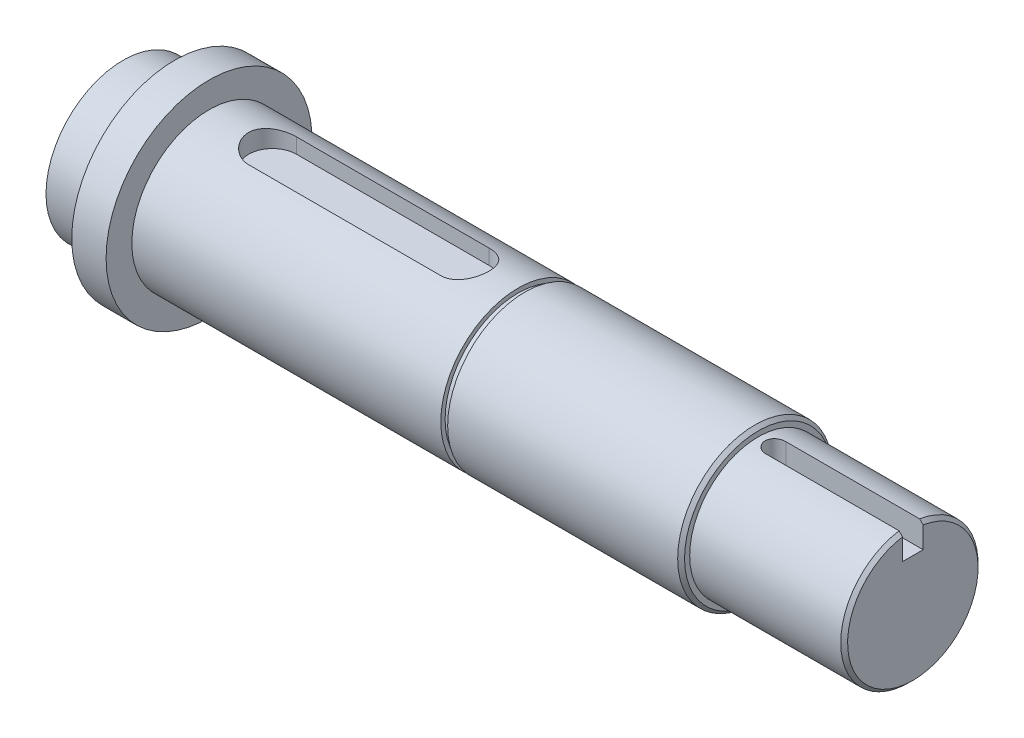
ISO-10303-21;
HEADER;
FILE_DESCRIPTION(('STEP AP214'),'2;1');
FILE_NAME('part.step','',(''),(''),'','','');
FILE_SCHEMA(('AUTOMOTIVE_DESIGN { 1 0 10303 214 1 1 1 1 }'));
ENDSEC;
DATA;
#1=APPLICATION_CONTEXT('core data for automotive mechanical design processes');
#2=APPLICATION_PROTOCOL_DEFINITION('international standard','automotive_design',2000,#1);
#3=PRODUCT_CONTEXT('',#1,'mechanical');
#4=PRODUCT('Part','Part','',(#3));
#5=PRODUCT_RELATED_PRODUCT_CATEGORY('part','',(#4));
#6=PRODUCT_DEFINITION_FORMATION('','',#4);
#7=PRODUCT_DEFINITION_CONTEXT('part definition',#1,'design');
#8=PRODUCT_DEFINITION('design','',#6,#7);
#9=PRODUCT_DEFINITION_SHAPE('','',#8);
#10=(LENGTH_UNIT() NAMED_UNIT(*) SI_UNIT(.MILLI.,.METRE.));
#11=(NAMED_UNIT(*) PLANE_ANGLE_UNIT() SI_UNIT($,.RADIAN.));
#12=(NAMED_UNIT(*) SI_UNIT($,.STERADIAN.) SOLID_ANGLE_UNIT());
#13=UNCERTAINTY_MEASURE_WITH_UNIT(LENGTH_MEASURE(1.E-05),#10,'distance_accuracy_value','');
#14=(GEOMETRIC_REPRESENTATION_CONTEXT(3) GLOBAL_UNCERTAINTY_ASSIGNED_CONTEXT((#13)) GLOBAL_UNIT_ASSIGNED_CONTEXT((#10,
#11,#12)) REPRESENTATION_CONTEXT('',''));
#15=CARTESIAN_POINT('',(0.,0.,0.));
#16=DIRECTION('',(0.,0.,1.));
#17=DIRECTION('',(1.,0.,0.));
#18=AXIS2_PLACEMENT_3D('',#15,#16,#17);
#19=CARTESIAN_POINT('',(0.,0.,0.));
#20=DIRECTION('',(1.,0.,0.));
#21=DIRECTION('',(0.,0.,-1.));
#22=AXIS2_PLACEMENT_3D('',#19,#20,#21);
#23=PLANE('',#22);
#24=CARTESIAN_POINT('',(0.,0.,0.));
#25=DIRECTION('',(-1.,0.,0.));
#26=DIRECTION('',(0.,0.,1.));
#27=AXIS2_PLACEMENT_3D('',#24,#25,#26);
#28=CIRCLE('',#27,22.5);
#29=CARTESIAN_POINT('',(0.,0.,22.5));
#30=VERTEX_POINT('',#29);
#31=EDGE_CURVE('E197',#30,#30,#28,.T.);
#32=ORIENTED_EDGE('',*,*,#31,.T.);
#33=EDGE_LOOP('',(#32));
#34=FACE_BOUND('',#33,.T.);
#35=ADVANCED_FACE('F42',(#34),#23,.F.);
#36=CARTESIAN_POINT('',(-258.805394990366,0.,0.));
#37=DIRECTION('',(-1.,0.,0.));
#38=DIRECTION('',(0.,0.,1.));
#39=AXIS2_PLACEMENT_3D('',#36,#37,#38);
#40=CYLINDRICAL_SURFACE('',#39,22.5);
#41=ORIENTED_EDGE('',*,*,#31,.F.);
#42=EDGE_LOOP('',(#41));
#43=FACE_BOUND('',#42,.T.);
#44=CARTESIAN_POINT('',(15.,0.,0.));
#45=DIRECTION('',(-1.,0.,0.));
#46=DIRECTION('',(0.,0.,1.));
#47=AXIS2_PLACEMENT_3D('',#44,#45,#46);
#48=CIRCLE('',#47,22.5);
#49=CARTESIAN_POINT('',(15.,0.,22.5));
#50=VERTEX_POINT('',#49);
#51=EDGE_CURVE('E194',#50,#50,#48,.T.);
#52=ORIENTED_EDGE('',*,*,#51,.T.);
#53=EDGE_LOOP('',(#52));
#54=FACE_BOUND('',#53,.T.);
#55=ADVANCED_FACE('F291',(#43,#54),#40,.T.);
#56=CARTESIAN_POINT('',(15.,22.5,0.));
#57=DIRECTION('',(1.,0.,0.));
#58=DIRECTION('',(0.,0.,-1.));
#59=AXIS2_PLACEMENT_3D('',#56,#57,#58);
#60=PLANE('',#59);
#61=ORIENTED_EDGE('',*,*,#51,.F.);
#62=EDGE_LOOP('',(#61));
#63=FACE_BOUND('',#62,.T.);
#64=CARTESIAN_POINT('',(15.,0.,0.));
#65=DIRECTION('',(-1.,0.,0.));
#66=DIRECTION('',(0.,0.,1.));
#67=AXIS2_PLACEMENT_3D('',#64,#65,#66);
#68=CIRCLE('',#67,30.);
#69=CARTESIAN_POINT('',(15.,0.,30.));
#70=VERTEX_POINT('',#69);
#71=EDGE_CURVE('E191',#70,#70,#68,.T.);
#72=ORIENTED_EDGE('',*,*,#71,.T.);
#73=EDGE_LOOP('',(#72));
#74=FACE_BOUND('',#73,.T.);
#75=ADVANCED_FACE('F296',(#63,#74),#60,.F.);
#76=CARTESIAN_POINT('',(-258.805394990366,0.,0.));
#77=DIRECTION('',(-1.,0.,0.));
#78=DIRECTION('',(0.,0.,1.));
#79=AXIS2_PLACEMENT_3D('',#76,#77,#78);
#80=CYLINDRICAL_SURFACE('',#79,30.);
#81=ORIENTED_EDGE('',*,*,#71,.F.);
#82=EDGE_LOOP('',(#81));
#83=FACE_BOUND('',#82,.T.);
#84=CARTESIAN_POINT('',(25.,0.,0.));
#85=DIRECTION('',(-1.,0.,0.));
#86=DIRECTION('',(0.,0.,1.));
#87=AXIS2_PLACEMENT_3D('',#84,#85,#86);
#88=CIRCLE('',#87,30.);
#89=CARTESIAN_POINT('',(25.,0.,30.));
#90=VERTEX_POINT('',#89);
#91=EDGE_CURVE('E188',#90,#90,#88,.T.);
#92=ORIENTED_EDGE('',*,*,#91,.T.);
#93=EDGE_LOOP('',(#92));
#94=FACE_BOUND('',#93,.T.);
#95=ADVANCED_FACE('F302',(#83,#94),#80,.T.);
#96=CARTESIAN_POINT('',(25.,30.,0.));
#97=DIRECTION('',(-1.,0.,0.));
#98=DIRECTION('',(0.,0.,1.));
#99=AXIS2_PLACEMENT_3D('',#96,#97,#98);
#100=PLANE('',#99);
#101=ORIENTED_EDGE('',*,*,#91,.F.);
#102=EDGE_LOOP('',(#101));
#103=FACE_BOUND('',#102,.T.);
#104=CARTESIAN_POINT('',(25.,0.,0.));
#105=DIRECTION('',(-1.,0.,0.));
#106=DIRECTION('',(0.,0.,1.));
#107=AXIS2_PLACEMENT_3D('',#104,#105,#106);
#108=CIRCLE('',#107,22.5);
#109=CARTESIAN_POINT('',(25.,0.,22.5));
#110=VERTEX_POINT('',#109);
#111=EDGE_CURVE('E185',#110,#110,#108,.T.);
#112=ORIENTED_EDGE('',*,*,#111,.T.);
#113=EDGE_LOOP('',(#112));
#114=FACE_BOUND('',#113,.T.);
#115=ADVANCED_FACE('F305',(#103,#114),#100,.F.);
#116=CARTESIAN_POINT('',(-258.805394990366,0.,0.));
#117=DIRECTION('',(-1.,0.,0.));
#118=DIRECTION('',(0.,0.,1.));
#119=AXIS2_PLACEMENT_3D('',#116,#117,#118);
#120=CYLINDRICAL_SURFACE('',#119,22.5);
#121=DIRECTION('',(-1.,0.,0.));
#122=VECTOR('',#121,1.);
#123=CARTESIAN_POINT('',(-258.805394990366,21.3834047803431,-7.));
#124=LINE('',#123,#122);
#125=CARTESIAN_POINT('',(43.5,21.3834047803431,-7.));
#126=VERTEX_POINT('',#125);
#127=CARTESIAN_POINT('',(99.5,21.3834047803431,-7.));
#128=VERTEX_POINT('',#127);
#129=EDGE_CURVE('E12',#126,#128,#124,.F.);
#130=ORIENTED_EDGE('',*,*,#129,.T.);
#131=CARTESIAN_POINT('',(99.5,21.3834047803431,-7.));
#132=CARTESIAN_POINT('',(99.691747962933,21.3833759755726,-7.00002638788773));
#133=CARTESIAN_POINT('',(99.8834853215038,21.3859829575454,-6.99212250357733));
#134=CARTESIAN_POINT('',(100.265489058962,21.3962580072183,-6.96064990633983));
#135=CARTESIAN_POINT('',(100.455755778655,21.4039248644627,-6.93708493994703));
#136=CARTESIAN_POINT('',(100.832958103102,21.4240824611325,-6.87456915635527));
#137=CARTESIAN_POINT('',(101.019901235473,21.4365602872848,-6.83565951993686));
#138=CARTESIAN_POINT('',(101.389662295551,21.4659469063578,-6.74281154744467));
#139=CARTESIAN_POINT('',(101.572480102144,21.4828558291851,-6.68887277075807));
#140=CARTESIAN_POINT('',(101.932628173539,21.5205859002674,-6.56646575510685));
#141=CARTESIAN_POINT('',(102.109961967382,21.5414044689111,-6.49800709263032));
#142=CARTESIAN_POINT('',(102.458189970023,21.5863628741255,-6.34705748516684));
#143=CARTESIAN_POINT('',(102.629081759612,21.6105039428958,-6.26456133146705));
#144=CARTESIAN_POINT('',(102.963322979925,21.6614246049304,-6.0861552368472));
#145=CARTESIAN_POINT('',(103.126671560951,21.6882044943834,-5.99024378964968));
#146=CARTESIAN_POINT('',(103.444892740823,21.7436799451747,-5.78563893862382));
#147=CARTESIAN_POINT('',(103.599762274424,21.7723761910783,-5.67694095648713));
#148=CARTESIAN_POINT('',(103.904649878951,21.8318094528287,-5.44398558349853));
#149=CARTESIAN_POINT('',(104.054375697672,21.8625820218381,-5.31935461263557));
#150=CARTESIAN_POINT('',(104.342885258309,21.9244995602668,-5.05809625572506));
#151=CARTESIAN_POINT('',(104.481668816275,21.9556445359364,-4.92146866808486));
#152=CARTESIAN_POINT('',(104.747469283069,22.0174752796029,-4.63702147167283));
#153=CARTESIAN_POINT('',(104.874482110225,22.0481608852367,-4.48919801262155));
#154=CARTESIAN_POINT('',(105.115815118575,22.1082274768052,-4.18336601580314));
#155=CARTESIAN_POINT('',(105.230139713703,22.1376089142809,-4.02536105036416));
#156=CARTESIAN_POINT('',(105.44782013432,22.1949382761817,-3.69637926494411));
#157=CARTESIAN_POINT('',(105.550865802136,22.222838133295,-3.52518859648671));
#158=CARTESIAN_POINT('',(105.742077396034,22.2756613074277,-3.17432985879873));
#159=CARTESIAN_POINT('',(105.83024877474,22.3005857142056,-2.99466492710899));
#160=CARTESIAN_POINT('',(105.991027505679,22.3467560378169,-2.62804567748408));
#161=CARTESIAN_POINT('',(106.063635279951,22.3680020543947,-2.44109155737344));
#162=CARTESIAN_POINT('',(106.192644415018,22.4061975627029,-2.06124657398028));
#163=CARTESIAN_POINT('',(106.249046375157,22.4231472133242,-1.86835593054216));
#164=CARTESIAN_POINT('',(106.343645794008,22.4518043567541,-1.48406965496813));
#165=CARTESIAN_POINT('',(106.382347442615,22.4636563728524,-1.29280885191943));
#166=CARTESIAN_POINT('',(106.443666983921,22.4825189363242,-0.907492281435932));
#167=CARTESIAN_POINT('',(106.466285431422,22.4895296507013,-0.713436610647587));
#168=CARTESIAN_POINT('',(106.495221071183,22.4985094688896,-0.324029619574405));
#169=CARTESIAN_POINT('',(106.501540971608,22.5004794102745,-0.128678519946821));
#170=CARTESIAN_POINT('',(106.497825624669,22.4993235348161,0.261850976266975));
#171=CARTESIAN_POINT('',(106.487790702297,22.4961978192299,0.457029376207834));
#172=CARTESIAN_POINT('',(106.452091279248,22.4851350756934,0.839016651756691));
#173=CARTESIAN_POINT('',(106.426977198409,22.4773675290497,1.02588219704709));
#174=CARTESIAN_POINT('',(106.361806715502,22.4573691656826,1.39681014394023));
#175=CARTESIAN_POINT('',(106.321745326667,22.4451368594423,1.58087158867604));
#176=CARTESIAN_POINT('',(106.227040771032,22.4165350301791,1.94480498225261));
#177=CARTESIAN_POINT('',(106.172402466504,22.4001668868012,2.12467830636909));
#178=CARTESIAN_POINT('',(106.048962208332,22.3637078769714,2.47918052521276));
#179=CARTESIAN_POINT('',(105.980154922154,22.3436156092208,2.65380741699503));
#180=CARTESIAN_POINT('',(105.828027310215,22.2999677081418,2.99866751070753));
#181=CARTESIAN_POINT('',(105.744545249901,22.2763739905048,3.16882451147411));
#182=CARTESIAN_POINT('',(105.564226510845,22.2265007734939,3.50156811170554));
#183=CARTESIAN_POINT('',(105.467385253138,22.2002203540359,3.66415208979079));
#184=CARTESIAN_POINT('',(105.261038630503,22.1456467231703,3.98072025747788));
#185=CARTESIAN_POINT('',(105.151532951898,22.1173534619146,4.13470423393206));
#186=CARTESIAN_POINT('',(104.920570196103,22.0594670226099,4.4331736760406));
#187=CARTESIAN_POINT('',(104.799112742727,22.0298738036607,4.57765884247862));
#188=CARTESIAN_POINT('',(104.539724709995,21.9688936108202,4.86207108102337));
#189=CARTESIAN_POINT('',(104.401320039388,21.9374831254957,5.00156109200341));
#190=CARTESIAN_POINT('',(104.113294186339,21.8749338799794,5.26840074524967));
#191=CARTESIAN_POINT('',(103.963676595185,21.8437950363228,5.39575424517763));
#192=CARTESIAN_POINT('',(103.654016640235,21.7826262792731,5.63762072887128));
#193=CARTESIAN_POINT('',(103.493967320647,21.7525971271591,5.75212500350362));
#194=CARTESIAN_POINT('',(103.164603799852,21.6945398510365,5.96735827855913));
#195=CARTESIAN_POINT('',(102.995293241572,21.6665109500826,6.0680926416173));
#196=CARTESIAN_POINT('',(102.64635431279,21.6129469743072,6.25621355677311));
#197=CARTESIAN_POINT('',(102.466626662005,21.5874457842966,6.34342581409757));
#198=CARTESIAN_POINT('',(102.10003436718,21.5401290954628,6.50228494842817));
#199=CARTESIAN_POINT('',(101.913172696296,21.5183120813529,6.57393822826235));
#200=CARTESIAN_POINT('',(101.533782862087,21.4790763704547,6.70102264969051));
#201=CARTESIAN_POINT('',(101.341260960584,21.4616530033951,6.75647102650282));
#202=CARTESIAN_POINT('',(100.951885948128,21.4317592713336,6.85070294339748));
#203=CARTESIAN_POINT('',(100.755034871999,21.4192866297424,6.88949414394962));
#204=CARTESIAN_POINT('',(100.381992589154,21.4008759333036,6.94646198663147));
#205=CARTESIAN_POINT('',(100.206118439217,21.3943385336146,6.96653718585291));
#206=CARTESIAN_POINT('',(99.8535006576593,21.3855959359006,6.99330547974964));
#207=CARTESIAN_POINT('',(99.6767586183217,21.3833845899213,7.00001756560227));
#208=CARTESIAN_POINT('',(99.5,21.3834047803431,7.));
#209=B_SPLINE_CURVE_WITH_KNOTS('',3,(#131,#132,#133,#134,#135,#136,#137,#138,#139,#140,#141,
#142,#143,#144,#145,#146,#147,#148,#149,#150,#151,#152,#153,#154,#155,#156,#157,#158,#159,#160,
#161,#162,#163,#164,#165,#166,#167,#168,#169,#170,#171,#172,#173,#174,#175,#176,#177,#178,#179,
#180,#181,#182,#183,#184,#185,#186,#187,#188,#189,#190,#191,#192,#193,#194,#195,#196,#197,#198,
#199,#200,#201,#202,#203,#204,#205,#206,#207,#208),.UNSPECIFIED.,.F.,.F.,(4,2,2,2,2,2,2,2,2,2,2,
2,2,2,2,2,2,2,2,2,2,2,2,2,2,2,2,2,2,2,2,2,2,2,2,2,2,2,4),(0.,0.575046969806877,1.14995642305859,
1.72333336736907,2.29672712327433,2.86974387087759,3.44297370600941,4.01626795548503,
4.58976810539893,5.18076864034281,5.77177910843487,6.36299375708562,6.95400208730354,
7.55850874723,8.16279332293318,8.76706151008844,9.37130734653417,9.95706552574568,
10.5428034978567,11.1284441375358,11.7140731399452,12.2795246614735,12.8451649995772,
13.4106168982253,13.9762819963941,14.5486246379559,15.1211639439558,15.6937174338259,
16.2662889507273,16.8625896714317,17.4587002177891,18.055212394766,18.6514915966369,
19.2549115963138,19.8580828040918,20.460610136413,21.0628600748604,21.5937197869136,
22.1238245201084),.UNSPECIFIED.);
#210=CARTESIAN_POINT('',(99.5,21.3834047803431,7.));
#211=VERTEX_POINT('',#210);
#212=EDGE_CURVE('E253',#128,#211,#209,.T.);
#213=ORIENTED_EDGE('',*,*,#212,.T.);
#214=DIRECTION('',(-1.,0.,0.));
#215=VECTOR('',#214,1.);
#216=CARTESIAN_POINT('',(-258.805394990366,21.3834047803431,7.));
#217=LINE('',#216,#215);
#218=CARTESIAN_POINT('',(43.5,21.3834047803431,7.));
#219=VERTEX_POINT('',#218);
#220=EDGE_CURVE('E50',#211,#219,#217,.T.);
#221=ORIENTED_EDGE('',*,*,#220,.T.);
#222=CARTESIAN_POINT('',(43.5,21.3834047803431,7.));
#223=CARTESIAN_POINT('',(43.3082520370671,21.3833759755726,7.00002638788773));
#224=CARTESIAN_POINT('',(43.1165146784963,21.3859829575454,6.99212250357733));
#225=CARTESIAN_POINT('',(42.7345109410377,21.3962580072183,6.96064990633983));
#226=CARTESIAN_POINT('',(42.5442442213453,21.4039248644627,6.93708493994703));
#227=CARTESIAN_POINT('',(42.1670418968984,21.4240824611325,6.87456915635527));
#228=CARTESIAN_POINT('',(41.9800987645274,21.4365602872848,6.83565951993687));
#229=CARTESIAN_POINT('',(41.6103377044495,21.4659469063578,6.74281154744467));
#230=CARTESIAN_POINT('',(41.4275198978557,21.4828558291851,6.68887277075807));
#231=CARTESIAN_POINT('',(41.0673718264613,21.5205859002674,6.56646575510685));
#232=CARTESIAN_POINT('',(40.8900380326178,21.5414044689111,6.49800709263033));
#233=CARTESIAN_POINT('',(40.5418100299767,21.5863628741255,6.34705748516684));
#234=CARTESIAN_POINT('',(40.3709182403882,21.6105039428958,6.26456133146706));
#235=CARTESIAN_POINT('',(40.0366770200747,21.6614246049304,6.0861552368472));
#236=CARTESIAN_POINT('',(39.8733284390492,21.6882044943834,5.99024378964969));
#237=CARTESIAN_POINT('',(39.5551072591769,21.7436799451747,5.78563893862383));
#238=CARTESIAN_POINT('',(39.4002377255763,21.7723761910783,5.67694095648714));
#239=CARTESIAN_POINT('',(39.0953501210494,21.8318094528287,5.44398558349853));
#240=CARTESIAN_POINT('',(38.9456243023278,21.8625820218381,5.31935461263558));
#241=CARTESIAN_POINT('',(38.6571147416907,21.9244995602668,5.05809625572507));
#242=CARTESIAN_POINT('',(38.5183311837246,21.9556445359364,4.92146866808487));
#243=CARTESIAN_POINT('',(38.2525307169311,22.0174752796029,4.63702147167283));
#244=CARTESIAN_POINT('',(38.1255178897753,22.0481608852367,4.48919801262155));
#245=CARTESIAN_POINT('',(37.884184881425,22.1082274768052,4.18336601580314));
#246=CARTESIAN_POINT('',(37.7698602862973,22.1376089142809,4.02536105036415));
#247=CARTESIAN_POINT('',(37.55217986568,22.1949382761817,3.6963792649441));
#248=CARTESIAN_POINT('',(37.4491341978637,22.222838133295,3.5251885964867));
#249=CARTESIAN_POINT('',(37.2579226039664,22.2756613074277,3.17432985879873));
#250=CARTESIAN_POINT('',(37.16975122526,22.3005857142056,2.99466492710898));
#251=CARTESIAN_POINT('',(37.0089724943215,22.3467560378169,2.62804567748407));
#252=CARTESIAN_POINT('',(36.9363647200488,22.3680020543947,2.44109155737343));
#253=CARTESIAN_POINT('',(36.8073555849817,22.4061975627029,2.06124657398027));
#254=CARTESIAN_POINT('',(36.7509536248428,22.4231472133242,1.86835593054215));
#255=CARTESIAN_POINT('',(36.6563542059918,22.4518043567541,1.48406965496813));
#256=CARTESIAN_POINT('',(36.6176525573853,22.4636563728524,1.29280885191943));
#257=CARTESIAN_POINT('',(36.5563330160787,22.4825189363242,0.907492281435928));
#258=CARTESIAN_POINT('',(36.5337145685779,22.4895296507013,0.713436610647583));
#259=CARTESIAN_POINT('',(36.5047789288171,22.4985094688896,0.324029619574402));
#260=CARTESIAN_POINT('',(36.4984590283923,22.5004794102745,0.128678519946818));
#261=CARTESIAN_POINT('',(36.5021743753308,22.4993235348161,-0.261850976266977));
#262=CARTESIAN_POINT('',(36.5122092977033,22.4961978192299,-0.457029376207836));
#263=CARTESIAN_POINT('',(36.5479087207522,22.4851350756934,-0.839016651756693));
#264=CARTESIAN_POINT('',(36.5730228015911,22.4773675290497,-1.02588219704709));
#265=CARTESIAN_POINT('',(36.6381932844985,22.4573691656826,-1.39681014394023));
#266=CARTESIAN_POINT('',(36.6782546733331,22.4451368594423,-1.58087158867604));
#267=CARTESIAN_POINT('',(36.7729592289679,22.4165350301791,-1.94480498225261));
#268=CARTESIAN_POINT('',(36.827597533496,22.4001668868012,-2.12467830636909));
#269=CARTESIAN_POINT('',(36.9510377916683,22.3637078769714,-2.47918052521276));
#270=CARTESIAN_POINT('',(37.0198450778458,22.3436156092208,-2.65380741699503));
#271=CARTESIAN_POINT('',(37.1719726897852,22.2999677081418,-2.99866751070753));
#272=CARTESIAN_POINT('',(37.2554547500994,22.2763739905048,-3.1688245114741));
#273=CARTESIAN_POINT('',(37.4357734891551,22.2265007734939,-3.50156811170554));
#274=CARTESIAN_POINT('',(37.5326147468621,22.2002203540359,-3.66415208979079));
#275=CARTESIAN_POINT('',(37.7389613694973,22.1456467231703,-3.98072025747787));
#276=CARTESIAN_POINT('',(37.8484670481018,22.1173534619146,-4.13470423393205));
#277=CARTESIAN_POINT('',(38.0794298038973,22.0594670226099,-4.43317367604059));
#278=CARTESIAN_POINT('',(38.2008872572734,22.0298738036607,-4.57765884247862));
#279=CARTESIAN_POINT('',(38.4602752900053,21.9688936108202,-4.86207108102337));
#280=CARTESIAN_POINT('',(38.5986799606122,21.9374831254957,-5.0015610920034));
#281=CARTESIAN_POINT('',(38.8867058136609,21.8749338799794,-5.26840074524966));
#282=CARTESIAN_POINT('',(39.0363234048154,21.8437950363228,-5.39575424517762));
#283=CARTESIAN_POINT('',(39.3459833597652,21.7826262792731,-5.63762072887127));
#284=CARTESIAN_POINT('',(39.5060326793534,21.7525971271591,-5.75212500350362));
#285=CARTESIAN_POINT('',(39.835396200148,21.6945398510365,-5.96735827855913));
#286=CARTESIAN_POINT('',(40.0047067584282,21.6665109500826,-6.0680926416173));
#287=CARTESIAN_POINT('',(40.3536456872099,21.6129469743072,-6.25621355677311));
#288=CARTESIAN_POINT('',(40.5333733379948,21.5874457842966,-6.34342581409757));
#289=CARTESIAN_POINT('',(40.8999656328203,21.5401290954628,-6.50228494842818));
#290=CARTESIAN_POINT('',(41.0868273037043,21.5183120813529,-6.57393822826236));
#291=CARTESIAN_POINT('',(41.4662171379128,21.4790763704547,-6.70102264969051));
#292=CARTESIAN_POINT('',(41.6587390394159,21.4616530033951,-6.75647102650283));
#293=CARTESIAN_POINT('',(42.0481140518722,21.4317592713336,-6.85070294339748));
#294=CARTESIAN_POINT('',(42.2449651280007,21.4192866297424,-6.88949414394962));
#295=CARTESIAN_POINT('',(42.6180074108463,21.4008759333036,-6.94646198663147));
#296=CARTESIAN_POINT('',(42.7938815607828,21.3943385336146,-6.96653718585291));
#297=CARTESIAN_POINT('',(43.1464993423408,21.3855959359006,-6.99330547974964));
#298=CARTESIAN_POINT('',(43.3232413816784,21.3833845899213,-7.00001756560227));
#299=CARTESIAN_POINT('',(43.5,21.3834047803431,-7.));
#300=B_SPLINE_CURVE_WITH_KNOTS('',3,(#222,#223,#224,#225,#226,#227,#228,#229,#230,#231,#232,
#233,#234,#235,#236,#237,#238,#239,#240,#241,#242,#243,#244,#245,#246,#247,#248,#249,#250,#251,
#252,#253,#254,#255,#256,#257,#258,#259,#260,#261,#262,#263,#264,#265,#266,#267,#268,#269,#270,
#271,#272,#273,#274,#275,#276,#277,#278,#279,#280,#281,#282,#283,#284,#285,#286,#287,#288,#289,
#290,#291,#292,#293,#294,#295,#296,#297,#298,#299),.UNSPECIFIED.,.F.,.F.,(4,2,2,2,2,2,2,2,2,2,2,
2,2,2,2,2,2,2,2,2,2,2,2,2,2,2,2,2,2,2,2,2,2,2,2,2,2,2,4),(0.,0.57504696980687,1.14995642305858,
1.72333336736907,2.29672712327433,2.86974387087758,3.4429737060094,4.01626795548501,
4.58976810539893,5.18076864034279,5.77177910843487,6.36299375708563,6.95400208730355,
7.55850874723001,8.16279332293319,8.76706151008845,9.37130734653418,9.95706552574569,
10.5428034978567,11.1284441375358,11.7140731399452,12.2795246614735,12.8451649995772,
13.4106168982253,13.9762819963941,14.5486246379559,15.1211639439558,15.6937174338258,
16.2662889507273,16.8625896714317,17.4587002177891,18.055212394766,18.6514915966369,
19.2549115963138,19.8580828040918,20.460610136413,21.0628600748604,21.5937197869136,
22.1238245201084),.UNSPECIFIED.);
#301=EDGE_CURVE('E57',#219,#126,#300,.T.);
#302=ORIENTED_EDGE('',*,*,#301,.T.);
#303=EDGE_LOOP('',(#130,#213,#221,#302));
#304=FACE_BOUND('',#303,.T.);
#305=ORIENTED_EDGE('',*,*,#111,.F.);
#306=EDGE_LOOP('',(#305));
#307=FACE_BOUND('',#306,.T.);
#308=CARTESIAN_POINT('',(115.,0.,0.));
#309=DIRECTION('',(-1.,0.,0.));
#310=DIRECTION('',(0.,0.,1.));
#311=AXIS2_PLACEMENT_3D('',#308,#309,#310);
#312=CIRCLE('',#311,22.5);
#313=CARTESIAN_POINT('',(115.,0.,22.5));
#314=VERTEX_POINT('',#313);
#315=EDGE_CURVE('E182',#314,#314,#312,.T.);
#316=ORIENTED_EDGE('',*,*,#315,.T.);
#317=EDGE_LOOP('',(#316));
#318=FACE_BOUND('',#317,.T.);
#319=ADVANCED_FACE('F266',(#304,#307,#318),#120,.T.);
#320=CARTESIAN_POINT('',(115.,22.5,0.));
#321=DIRECTION('',(-1.,0.,0.));
#322=DIRECTION('',(0.,0.,1.));
#323=AXIS2_PLACEMENT_3D('',#320,#321,#322);
#324=PLANE('',#323);
#325=ORIENTED_EDGE('',*,*,#315,.F.);
#326=EDGE_LOOP('',(#325));
#327=FACE_BOUND('',#326,.T.);
#328=CARTESIAN_POINT('',(115.,0.,0.));
#329=DIRECTION('',(-1.,0.,0.));
#330=DIRECTION('',(0.,0.,1.));
#331=AXIS2_PLACEMENT_3D('',#328,#329,#330);
#332=CIRCLE('',#331,21.25);
#333=CARTESIAN_POINT('',(115.,0.,21.25));
#334=VERTEX_POINT('',#333);
#335=EDGE_CURVE('E179',#334,#334,#332,.T.);
#336=ORIENTED_EDGE('',*,*,#335,.T.);
#337=EDGE_LOOP('',(#336));
#338=FACE_BOUND('',#337,.T.);
#339=ADVANCED_FACE('F312',(#327,#338),#324,.F.);
#340=CARTESIAN_POINT('',(-258.805394990366,0.,0.));
#341=DIRECTION('',(-1.,0.,0.));
#342=DIRECTION('',(0.,0.,1.));
#343=AXIS2_PLACEMENT_3D('',#340,#341,#342);
#344=CYLINDRICAL_SURFACE('',#343,21.25);
#345=ORIENTED_EDGE('',*,*,#335,.F.);
#346=EDGE_LOOP('',(#345));
#347=FACE_BOUND('',#346,.T.);
#348=CARTESIAN_POINT('',(117.,0.,0.));
#349=DIRECTION('',(-1.,0.,0.));
#350=DIRECTION('',(0.,0.,1.));
#351=AXIS2_PLACEMENT_3D('',#348,#349,#350);
#352=CIRCLE('',#351,21.25);
#353=CARTESIAN_POINT('',(117.,0.,21.25));
#354=VERTEX_POINT('',#353);
#355=EDGE_CURVE('E176',#354,#354,#352,.T.);
#356=ORIENTED_EDGE('',*,*,#355,.T.);
#357=EDGE_LOOP('',(#356));
#358=FACE_BOUND('',#357,.T.);
#359=ADVANCED_FACE('F323',(#347,#358),#344,.T.);
#360=CARTESIAN_POINT('',(117.,21.25,0.));
#361=DIRECTION('',(1.,0.,0.));
#362=DIRECTION('',(0.,0.,-1.));
#363=AXIS2_PLACEMENT_3D('',#360,#361,#362);
#364=PLANE('',#363);
#365=ORIENTED_EDGE('',*,*,#355,.F.);
#366=EDGE_LOOP('',(#365));
#367=FACE_BOUND('',#366,.T.);
#368=CARTESIAN_POINT('',(117.,0.,0.));
#369=DIRECTION('',(-1.,0.,0.));
#370=DIRECTION('',(0.,0.,1.));
#371=AXIS2_PLACEMENT_3D('',#368,#369,#370);
#372=CIRCLE('',#371,22.5);
#373=CARTESIAN_POINT('',(117.,0.,22.5));
#374=VERTEX_POINT('',#373);
#375=EDGE_CURVE('E173',#374,#374,#372,.T.);
#376=ORIENTED_EDGE('',*,*,#375,.T.);
#377=EDGE_LOOP('',(#376));
#378=FACE_BOUND('',#377,.T.);
#379=ADVANCED_FACE('F328',(#367,#378),#364,.F.);
#380=CARTESIAN_POINT('',(-258.805394990366,0.,0.));
#381=DIRECTION('',(-1.,0.,0.));
#382=DIRECTION('',(0.,0.,1.));
#383=AXIS2_PLACEMENT_3D('',#380,#381,#382);
#384=CYLINDRICAL_SURFACE('',#383,22.5);
#385=CARTESIAN_POINT('',(184.,0.,0.));
#386=DIRECTION('',(-1.,0.,0.));
#387=DIRECTION('',(0.,0.,1.));
#388=AXIS2_PLACEMENT_3D('',#385,#386,#387);
#389=CIRCLE('',#388,22.5);
#390=CARTESIAN_POINT('',(184.,0.,22.5));
#391=VERTEX_POINT('',#390);
#392=EDGE_CURVE('E206',#391,#391,#389,.T.);
#393=ORIENTED_EDGE('',*,*,#392,.T.);
#394=EDGE_LOOP('',(#393));
#395=FACE_BOUND('',#394,.T.);
#396=ORIENTED_EDGE('',*,*,#375,.F.);
#397=EDGE_LOOP('',(#396));
#398=FACE_BOUND('',#397,.T.);
#399=ADVANCED_FACE('F334',(#395,#398),#384,.T.);
#400=CARTESIAN_POINT('',(185.,22.5,0.));
#401=DIRECTION('',(-1.,0.,0.));
#402=DIRECTION('',(0.,0.,1.));
#403=AXIS2_PLACEMENT_3D('',#400,#401,#402);
#404=PLANE('',#403);
#405=CARTESIAN_POINT('',(185.,0.,0.));
#406=DIRECTION('',(-1.,0.,0.));
#407=DIRECTION('',(0.,0.,1.));
#408=AXIS2_PLACEMENT_3D('',#405,#406,#407);
#409=CIRCLE('',#408,21.4999999999999);
#410=CARTESIAN_POINT('',(185.,0.,21.4999999999999));
#411=VERTEX_POINT('',#410);
#412=EDGE_CURVE('E209',#411,#411,#409,.F.);
#413=ORIENTED_EDGE('',*,*,#412,.T.);
#414=EDGE_LOOP('',(#413));
#415=FACE_BOUND('',#414,.T.);
#416=CARTESIAN_POINT('',(185.,0.,0.));
#417=DIRECTION('',(-1.,0.,0.));
#418=DIRECTION('',(0.,0.,1.));
#419=AXIS2_PLACEMENT_3D('',#416,#417,#418);
#420=CIRCLE('',#419,20.);
#421=CARTESIAN_POINT('',(185.,0.,20.));
#422=VERTEX_POINT('',#421);
#423=EDGE_CURVE('E170',#422,#422,#420,.T.);
#424=ORIENTED_EDGE('',*,*,#423,.T.);
#425=EDGE_LOOP('',(#424));
#426=FACE_BOUND('',#425,.T.);
#427=ADVANCED_FACE('F243',(#415,#426),#404,.F.);
#428=CARTESIAN_POINT('',(-258.805394990366,0.,0.));
#429=DIRECTION('',(-1.,0.,0.));
#430=DIRECTION('',(0.,0.,1.));
#431=AXIS2_PLACEMENT_3D('',#428,#429,#430);
#432=CYLINDRICAL_SURFACE('',#431,20.);
#433=CARTESIAN_POINT('',(229.,0.,0.));
#434=DIRECTION('',(-1.,0.,0.));
#435=DIRECTION('',(0.,0.,1.));
#436=AXIS2_PLACEMENT_3D('',#433,#434,#435);
#437=CIRCLE('',#436,20.);
#438=CARTESIAN_POINT('',(229.,19.7737199332852,-3.));
#439=VERTEX_POINT('',#438);
#440=CARTESIAN_POINT('',(229.,19.7737199332852,3.));
#441=VERTEX_POINT('',#440);
#442=EDGE_CURVE('E200',#439,#441,#437,.T.);
#443=ORIENTED_EDGE('',*,*,#442,.T.);
#444=DIRECTION('',(-1.,0.,0.));
#445=VECTOR('',#444,1.);
#446=CARTESIAN_POINT('',(-258.805394990366,19.7737199332852,3.00000000000004));
#447=LINE('',#446,#445);
#448=CARTESIAN_POINT('',(190.,19.7737199332852,3.));
#449=VERTEX_POINT('',#448);
#450=EDGE_CURVE('E167',#441,#449,#447,.T.);
#451=ORIENTED_EDGE('',*,*,#450,.T.);
#452=CARTESIAN_POINT('',(190.,19.7737199332852,3.));
#453=CARTESIAN_POINT('',(189.91612775859,19.7737146130445,3.0000086355163));
#454=CARTESIAN_POINT('',(189.832260001863,19.7742534481973,2.99648279437387));
#455=CARTESIAN_POINT('',(189.665133926469,19.7763800849375,2.98242907478176));
#456=CARTESIAN_POINT('',(189.581875553622,19.7779677920952,2.97190182666637));
#457=CARTESIAN_POINT('',(189.416649583065,19.7821504068792,2.94392847069931));
#458=CARTESIAN_POINT('',(189.334680596174,19.7847441404095,2.92649042766578));
#459=CARTESIAN_POINT('',(189.172540268779,19.7908593237067,2.88484422574279));
#460=CARTESIAN_POINT('',(189.092368922587,19.794380770538,2.86063608827644));
#461=CARTESIAN_POINT('',(188.855354309577,19.8061966140252,2.77807754347495));
#462=CARTESIAN_POINT('',(188.701906518024,19.8157453317081,2.70977528639416));
#463=CARTESIAN_POINT('',(188.408736610388,19.8371030292374,2.54870518483027));
#464=CARTESIAN_POINT('',(188.269014131915,19.8489119493833,2.45593798653568));
#465=CARTESIAN_POINT('',(188.006045555162,19.8735650548908,2.24776489430587));
#466=CARTESIAN_POINT('',(187.882922642905,19.8864159558474,2.13220391237109));
#467=CARTESIAN_POINT('',(187.657733239783,19.9116461822051,1.88205193975064));
#468=CARTESIAN_POINT('',(187.555669966898,19.9240254353016,1.74745804606329));
#469=CARTESIAN_POINT('',(187.375044589529,19.9469872740781,1.46226868553602));
#470=CARTESIAN_POINT('',(187.296597275937,19.9575609791932,1.31159973229829));
#471=CARTESIAN_POINT('',(187.166173649897,19.9756445750105,0.999048267958227));
#472=CARTESIAN_POINT('',(187.114194407617,19.9831548048001,0.837167000236362));
#473=CARTESIAN_POINT('',(187.038553711697,19.9942182287316,0.508064228478875));
#474=CARTESIAN_POINT('',(187.01468312743,19.9978006322674,0.340891789264339));
#475=CARTESIAN_POINT('',(186.995288016132,20.0007049110837,0.00487446011081301));
#476=CARTESIAN_POINT('',(186.999762591769,20.0000269212369,-0.163970376715561));
#477=CARTESIAN_POINT('',(187.036766729794,19.9945099850246,-0.497103935300262));
#478=CARTESIAN_POINT('',(187.069070526507,19.9897045238703,-0.661418368214606));
#479=CARTESIAN_POINT('',(187.160461577334,19.976509954662,-0.982266595361208));
#480=CARTESIAN_POINT('',(187.219549360888,19.9681207757685,-1.13880023572212));
#481=CARTESIAN_POINT('',(187.363063364915,19.9486436845886,-1.44033053573863));
#482=CARTESIAN_POINT('',(187.447585092767,19.9375456303629,-1.58528105640214));
#483=CARTESIAN_POINT('',(187.639494807294,19.9138882701456,-1.8590209181275));
#484=CARTESIAN_POINT('',(187.746883399111,19.9013289254868,-1.98780983134969));
#485=CARTESIAN_POINT('',(187.982719429443,19.8760049632111,-2.22689189500493));
#486=CARTESIAN_POINT('',(188.111361248092,19.8632395365886,-2.33699328253083));
#487=CARTESIAN_POINT('',(188.385443228748,19.839057360401,-2.53410732451871));
#488=CARTESIAN_POINT('',(188.530888242988,19.8276410023393,-2.62111328571042));
#489=CARTESIAN_POINT('',(188.834667960241,19.8074481748965,-2.76959223267003));
#490=CARTESIAN_POINT('',(188.99301986119,19.7986753034073,-2.8310304626496));
#491=CARTESIAN_POINT('',(189.317844513457,19.7848209900351,-2.92629713463421));
#492=CARTESIAN_POINT('',(189.484304691337,19.7797340154531,-2.96016696752407));
#493=CARTESIAN_POINT('',(189.710001326482,19.7757609037268,-2.9865200665207));
#494=CARTESIAN_POINT('',(189.767934450605,19.7749961608191,-2.99157728447236));
#495=CARTESIAN_POINT('',(189.883903384833,19.7739762264647,-2.99831279381061));
#496=CARTESIAN_POINT('',(189.9419388574,19.7737201785525,-2.99999676461186));
#497=CARTESIAN_POINT('',(190.,19.7737199332852,-2.99999999999999));
#498=B_SPLINE_CURVE_WITH_KNOTS('',3,(#452,#453,#454,#455,#456,#457,#458,#459,#460,#461,#462,
#463,#464,#465,#466,#467,#468,#469,#470,#471,#472,#473,#474,#475,#476,#477,#478,#479,#480,#481,
#482,#483,#484,#485,#486,#487,#488,#489,#490,#491,#492,#493,#494,#495,#496,#497),.UNSPECIFIED.,
.F.,.F.,(4,2,2,2,2,2,2,2,2,2,2,2,2,2,2,2,2,2,2,2,2,2,4),(0.,0.25153298047906,0.503043318593954,
0.754261007269081,1.00547790100653,1.50759921100593,2.00970725988499,2.51535742930764,
3.0210848065575,3.5292321086363,4.03732315007839,4.54160957795375,5.0458800415413,
5.54609770639006,6.04632525950763,6.54845517558608,7.05059838154285,7.55761802708195,
8.0647844516206,8.57263806425764,9.07972777732417,9.2541288444022,9.42823603105395),.UNSPECIFIED.);
#499=CARTESIAN_POINT('',(190.,19.7737199332852,-2.99999999999999));
#500=VERTEX_POINT('',#499);
#501=EDGE_CURVE('E247',#449,#500,#498,.T.);
#502=ORIENTED_EDGE('',*,*,#501,.T.);
#503=DIRECTION('',(-1.,0.,0.));
#504=VECTOR('',#503,1.);
#505=CARTESIAN_POINT('',(-258.805394990366,19.7737199332852,-2.99999999999992));
#506=LINE('',#505,#504);
#507=EDGE_CURVE('E157',#500,#439,#506,.F.);
#508=ORIENTED_EDGE('',*,*,#507,.T.);
#509=EDGE_LOOP('',(#443,#451,#502,#508));
#510=FACE_BOUND('',#509,.T.);
#511=ORIENTED_EDGE('',*,*,#423,.F.);
#512=EDGE_LOOP('',(#511));
#513=FACE_BOUND('',#512,.T.);
#514=ADVANCED_FACE('F238',(#510,#513),#432,.T.);
#515=CARTESIAN_POINT('',(230.,20.,0.));
#516=DIRECTION('',(-1.,0.,0.));
#517=DIRECTION('',(0.,0.,1.));
#518=AXIS2_PLACEMENT_3D('',#515,#516,#517);
#519=PLANE('',#518);
#520=DIRECTION('',(0.,0.,-1.));
#521=VECTOR('',#520,1.);
#522=CARTESIAN_POINT('',(230.,12.5,0.));
#523=LINE('',#522,#521);
#524=CARTESIAN_POINT('',(230.,12.5,3.));
#525=VERTEX_POINT('',#524);
#526=CARTESIAN_POINT('',(230.,12.5,-3.));
#527=VERTEX_POINT('',#526);
#528=EDGE_CURVE('E254',#525,#527,#523,.T.);
#529=ORIENTED_EDGE('',*,*,#528,.F.);
#530=DIRECTION('',(0.,1.,0.));
#531=VECTOR('',#530,1.);
#532=CARTESIAN_POINT('',(230.,12.5,3.));
#533=LINE('',#532,#531);
#534=CARTESIAN_POINT('',(230.,18.7616630392937,3.));
#535=VERTEX_POINT('',#534);
#536=EDGE_CURVE('E154',#525,#535,#533,.T.);
#537=ORIENTED_EDGE('',*,*,#536,.T.);
#538=CARTESIAN_POINT('',(230.,0.,0.));
#539=DIRECTION('',(-1.,0.,0.));
#540=DIRECTION('',(0.,0.,1.));
#541=AXIS2_PLACEMENT_3D('',#538,#539,#540);
#542=CIRCLE('',#541,19.);
#543=CARTESIAN_POINT('',(230.,18.7616630392937,-3.));
#544=VERTEX_POINT('',#543);
#545=EDGE_CURVE('E203',#535,#544,#542,.F.);
#546=ORIENTED_EDGE('',*,*,#545,.T.);
#547=DIRECTION('',(0.,1.,0.));
#548=VECTOR('',#547,1.);
#549=CARTESIAN_POINT('',(230.,12.5,-3.));
#550=LINE('',#549,#548);
#551=EDGE_CURVE('E65',#527,#544,#550,.T.);
#552=ORIENTED_EDGE('',*,*,#551,.F.);
#553=EDGE_LOOP('',(#529,#537,#546,#552));
#554=FACE_BOUND('',#553,.T.);
#555=ADVANCED_FACE('F235',(#554),#519,.F.);
#556=CARTESIAN_POINT('',(229.,0.,0.));
#557=DIRECTION('',(-1.,0.,0.));
#558=DIRECTION('',(0.,0.,1.));
#559=AXIS2_PLACEMENT_3D('',#556,#557,#558);
#560=CONICAL_SURFACE('',#559,20.,0.785398163397454);
#561=CARTESIAN_POINT('',(219.863187686496,28.9819570041843,3.));
#562=CARTESIAN_POINT('',(220.675916117807,28.1648687443335,3.));
#563=CARTESIAN_POINT('',(221.488477853449,27.3476144980368,3.));
#564=CARTESIAN_POINT('',(223.113118753357,25.7126294228257,3.));
#565=CARTESIAN_POINT('',(223.925197918482,24.8948985947666,3.));
#566=CARTESIAN_POINT('',(225.548713157939,23.2588271823804,3.));
#567=CARTESIAN_POINT('',(226.360149243308,22.4404866090083,3.));
#568=CARTESIAN_POINT('',(227.982155836389,20.80294440375,3.));
#569=CARTESIAN_POINT('',(228.792726342263,19.9837427700424,3.));
#570=CARTESIAN_POINT('',(230.412647303089,18.3440935111417,3.));
#571=CARTESIAN_POINT('',(231.22199772713,17.5236458554032,3.));
#572=CARTESIAN_POINT('',(232.838849153033,15.8809363828172,3.));
#573=CARTESIAN_POINT('',(233.646350164087,15.0586745750264,3.));
#574=CARTESIAN_POINT('',(234.855372575841,13.8230813650633,3.));
#575=CARTESIAN_POINT('',(235.258013208305,13.4108453950431,3.));
#576=CARTESIAN_POINT('',(236.062305805839,12.5854115952971,3.));
#577=CARTESIAN_POINT('',(236.463957773146,12.1722137677513,3.));
#578=CARTESIAN_POINT('',(237.265950355229,11.344532594325,3.));
#579=CARTESIAN_POINT('',(237.666290947585,10.9300492266994,3.));
#580=CARTESIAN_POINT('',(238.265428596664,10.3070003843691,3.));
#581=CARTESIAN_POINT('',(238.464913036179,10.0990960045513,3.));
#582=CARTESIAN_POINT('',(238.863327168599,9.68275560320676,3.));
#583=CARTESIAN_POINT('',(239.062256860305,9.47431958053147,3.));
#584=CARTESIAN_POINT('',(239.260860505473,9.26557273425944,3.));
#585=B_SPLINE_CURVE_WITH_KNOTS('',3,(#561,#562,#563,#564,#565,#566,#567,#568,#569,#570,#571,
#572,#573,#574,#575,#576,#577,#578,#579,#580,#581,#582,#583,#584),.UNSPECIFIED.,.F.,.F.,(4,2,2,
2,2,2,2,2,2,2,2,4),(0.,3.45737584456505,6.91474550309519,10.3720544750963,13.8293707756709,
17.2867732441148,20.7441584911771,22.4728914081964,24.2016204109294,25.9303788166759,
26.7947646552767,27.6591523627507),.UNSPECIFIED.);
#586=EDGE_CURVE('E218',#441,#535,#585,.T.);
#587=ORIENTED_EDGE('',*,*,#586,.F.);
#588=ORIENTED_EDGE('',*,*,#442,.F.);
#589=CARTESIAN_POINT('',(239.260860505473,9.26557273425944,-3.));
#590=CARTESIAN_POINT('',(238.933104125083,9.61002642660538,-3.));
#591=CARTESIAN_POINT('',(238.604495076233,9.95366572203226,-3.));
#592=CARTESIAN_POINT('',(237.945926382946,10.6396443465168,-3.));
#593=CARTESIAN_POINT('',(237.615966746262,10.9819836830138,-3.));
#594=CARTESIAN_POINT('',(236.955052273372,11.6656905856785,-3.));
#595=CARTESIAN_POINT('',(236.624097450535,12.0070581647822,-3.));
#596=CARTESIAN_POINT('',(235.961402361456,12.6890309953791,-3.));
#597=CARTESIAN_POINT('',(235.629662093915,13.0296362456106,-3.));
#598=CARTESIAN_POINT('',(234.633535557154,14.0505390258711,-3.));
#599=CARTESIAN_POINT('',(233.968229088502,14.7299385178914,-3.));
#600=CARTESIAN_POINT('',(232.636010271614,16.0871636522124,-3.));
#601=CARTESIAN_POINT('',(231.969097918682,16.7649892899002,-3.));
#602=CARTESIAN_POINT('',(231.018651969273,17.729388558514,-3.));
#603=CARTESIAN_POINT('',(230.735578600047,18.0164159335174,-3.));
#604=CARTESIAN_POINT('',(230.16925443917,18.5902967275399,-3.));
#605=CARTESIAN_POINT('',(229.886003647169,18.8771501462119,-3.));
#606=CARTESIAN_POINT('',(228.792717285324,19.9837541673467,-3.));
#607=CARTESIAN_POINT('',(227.982135708809,20.8029653459179,-3.));
#608=CARTESIAN_POINT('',(226.360106042374,22.4405296020191,-3.));
#609=CARTESIAN_POINT('',(225.548657952177,23.258882679273,-3.));
#610=CARTESIAN_POINT('',(223.925140801717,24.8949562889395,-3.));
#611=CARTESIAN_POINT('',(223.113071747754,25.7126768276051,-3.));
#612=CARTESIAN_POINT('',(221.488453210446,27.3476391985056,-3.));
#613=CARTESIAN_POINT('',(220.6759037275,28.1648810311363,-3.));
#614=CARTESIAN_POINT('',(219.863187686496,28.9819570041843,-3.));
#615=B_SPLINE_CURVE_WITH_KNOTS('',3,(#589,#590,#591,#592,#593,#594,#595,#596,#597,#598,#599,
#600,#601,#602,#603,#604,#605,#606,#607,#608,#609,#610,#611,#612,#613,#614),.UNSPECIFIED.,.F.,
.F.,(4,2,2,2,2,2,2,2,2,2,2,2,4),(0.,1.42640810329899,2.85280803138438,4.27918888187389,
5.70557209131144,8.55827614077819,11.4109885409196,12.6203838749249,13.8297816149572,
17.2871415037537,20.7445025047226,24.2018288791326,27.6591523906214),.UNSPECIFIED.);
#616=EDGE_CURVE('E212',#544,#439,#615,.T.);
#617=ORIENTED_EDGE('',*,*,#616,.F.);
#618=ORIENTED_EDGE('',*,*,#545,.F.);
#619=EDGE_LOOP('',(#587,#588,#617,#618));
#620=FACE_BOUND('',#619,.T.);
#621=ADVANCED_FACE('F224',(#620),#560,.T.);
#622=CARTESIAN_POINT('',(184.,0.,0.));
#623=DIRECTION('',(-1.,0.,0.));
#624=DIRECTION('',(0.,0.,1.));
#625=AXIS2_PLACEMENT_3D('',#622,#623,#624);
#626=CONICAL_SURFACE('',#625,22.5,0.785398163397436);
#627=ORIENTED_EDGE('',*,*,#412,.F.);
#628=EDGE_LOOP('',(#627));
#629=FACE_BOUND('',#628,.T.);
#630=ORIENTED_EDGE('',*,*,#392,.F.);
#631=EDGE_LOOP('',(#630));
#632=FACE_BOUND('',#631,.T.);
#633=ADVANCED_FACE('F44',(#629,#632),#626,.T.);
#634=CARTESIAN_POINT('',(190.,12.5,0.));
#635=DIRECTION('',(0.,1.,0.));
#636=DIRECTION('',(0.,0.,1.));
#637=AXIS2_PLACEMENT_3D('',#634,#635,#636);
#638=CYLINDRICAL_SURFACE('',#637,3.);
#639=DIRECTION('',(0.,1.,0.));
#640=VECTOR('',#639,1.);
#641=CARTESIAN_POINT('',(190.,12.5,3.));
#642=LINE('',#641,#640);
#643=CARTESIAN_POINT('',(190.,12.5,3.));
#644=VERTEX_POINT('',#643);
#645=EDGE_CURVE('E158',#644,#449,#642,.T.);
#646=ORIENTED_EDGE('',*,*,#645,.F.);
#647=CARTESIAN_POINT('',(190.,12.5,0.));
#648=DIRECTION('',(0.,1.,0.));
#649=DIRECTION('',(0.,0.,1.));
#650=AXIS2_PLACEMENT_3D('',#647,#648,#649);
#651=CIRCLE('',#650,3.);
#652=CARTESIAN_POINT('',(190.,12.5,-2.99999999999999));
#653=VERTEX_POINT('',#652);
#654=EDGE_CURVE('E148',#653,#644,#651,.T.);
#655=ORIENTED_EDGE('',*,*,#654,.F.);
#656=DIRECTION('',(0.,1.,0.));
#657=VECTOR('',#656,1.);
#658=CARTESIAN_POINT('',(190.,12.5,-2.99999999999999));
#659=LINE('',#658,#657);
#660=EDGE_CURVE('E161',#653,#500,#659,.T.);
#661=ORIENTED_EDGE('',*,*,#660,.T.);
#662=ORIENTED_EDGE('',*,*,#501,.F.);
#663=EDGE_LOOP('',(#646,#655,#661,#662));
#664=FACE_BOUND('',#663,.T.);
#665=ADVANCED_FACE('F233',(#664),#638,.F.);
#666=CARTESIAN_POINT('',(230.,12.5,0.));
#667=DIRECTION('',(0.,1.,0.));
#668=DIRECTION('',(0.,0.,1.));
#669=AXIS2_PLACEMENT_3D('',#666,#667,#668);
#670=PLANE('',#669);
#671=ORIENTED_EDGE('',*,*,#528,.T.);
#672=DIRECTION('',(-1.,0.,0.));
#673=VECTOR('',#672,1.);
#674=CARTESIAN_POINT('',(230.,12.5,-3.));
#675=LINE('',#674,#673);
#676=EDGE_CURVE('E141',#527,#653,#675,.T.);
#677=ORIENTED_EDGE('',*,*,#676,.T.);
#678=ORIENTED_EDGE('',*,*,#654,.T.);
#679=DIRECTION('',(1.,0.,0.));
#680=VECTOR('',#679,1.);
#681=CARTESIAN_POINT('',(230.,12.5,3.));
#682=LINE('',#681,#680);
#683=EDGE_CURVE('E151',#644,#525,#682,.T.);
#684=ORIENTED_EDGE('',*,*,#683,.T.);
#685=EDGE_LOOP('',(#671,#677,#678,#684));
#686=FACE_BOUND('',#685,.T.);
#687=ADVANCED_FACE('F282',(#686),#670,.T.);
#688=CARTESIAN_POINT('',(230.,12.5,3.));
#689=DIRECTION('',(0.,0.,1.));
#690=DIRECTION('',(1.,0.,0.));
#691=AXIS2_PLACEMENT_3D('',#688,#689,#690);
#692=PLANE('',#691);
#693=ORIENTED_EDGE('',*,*,#586,.T.);
#694=ORIENTED_EDGE('',*,*,#536,.F.);
#695=ORIENTED_EDGE('',*,*,#683,.F.);
#696=ORIENTED_EDGE('',*,*,#645,.T.);
#697=ORIENTED_EDGE('',*,*,#450,.F.);
#698=EDGE_LOOP('',(#693,#694,#695,#696,#697));
#699=FACE_BOUND('',#698,.T.);
#700=ADVANCED_FACE('F232',(#699),#692,.F.);
#701=CARTESIAN_POINT('',(230.,12.5,-3.));
#702=DIRECTION('',(0.,0.,-1.));
#703=DIRECTION('',(-1.,0.,0.));
#704=AXIS2_PLACEMENT_3D('',#701,#702,#703);
#705=PLANE('',#704);
#706=ORIENTED_EDGE('',*,*,#660,.F.);
#707=ORIENTED_EDGE('',*,*,#676,.F.);
#708=ORIENTED_EDGE('',*,*,#551,.T.);
#709=ORIENTED_EDGE('',*,*,#616,.T.);
#710=ORIENTED_EDGE('',*,*,#507,.F.);
#711=EDGE_LOOP('',(#706,#707,#708,#709,#710));
#712=FACE_BOUND('',#711,.T.);
#713=ADVANCED_FACE('F227',(#712),#705,.F.);
#714=CARTESIAN_POINT('',(43.5,17.,0.));
#715=DIRECTION('',(0.,1.,0.));
#716=DIRECTION('',(0.,0.,1.));
#717=AXIS2_PLACEMENT_3D('',#714,#715,#716);
#718=CYLINDRICAL_SURFACE('',#717,7.);
#719=DIRECTION('',(0.,1.,0.));
#720=VECTOR('',#719,1.);
#721=CARTESIAN_POINT('',(43.5,17.,7.));
#722=LINE('',#721,#720);
#723=CARTESIAN_POINT('',(43.5,17.,7.));
#724=VERTEX_POINT('',#723);
#725=EDGE_CURVE('E113',#724,#219,#722,.T.);
#726=ORIENTED_EDGE('',*,*,#725,.F.);
#727=CARTESIAN_POINT('',(43.5,17.,0.));
#728=DIRECTION('',(0.,1.,0.));
#729=DIRECTION('',(0.,0.,1.));
#730=AXIS2_PLACEMENT_3D('',#727,#728,#729);
#731=CIRCLE('',#730,7.);
#732=CARTESIAN_POINT('',(43.5,17.,-7.));
#733=VERTEX_POINT('',#732);
#734=EDGE_CURVE('E117',#733,#724,#731,.T.);
#735=ORIENTED_EDGE('',*,*,#734,.F.);
#736=DIRECTION('',(0.,1.,0.));
#737=VECTOR('',#736,1.);
#738=CARTESIAN_POINT('',(43.5,17.,-7.));
#739=LINE('',#738,#737);
#740=EDGE_CURVE('E139',#733,#126,#739,.T.);
#741=ORIENTED_EDGE('',*,*,#740,.T.);
#742=ORIENTED_EDGE('',*,*,#301,.F.);
#743=EDGE_LOOP('',(#726,#735,#741,#742));
#744=FACE_BOUND('',#743,.T.);
#745=ADVANCED_FACE('F115',(#744),#718,.F.);
#746=CARTESIAN_POINT('',(43.5,17.,-7.));
#747=DIRECTION('',(0.,0.,-1.));
#748=DIRECTION('',(-1.,0.,0.));
#749=AXIS2_PLACEMENT_3D('',#746,#747,#748);
#750=PLANE('',#749);
#751=ORIENTED_EDGE('',*,*,#740,.F.);
#752=DIRECTION('',(-1.,0.,0.));
#753=VECTOR('',#752,1.);
#754=CARTESIAN_POINT('',(43.5,17.,-7.));
#755=LINE('',#754,#753);
#756=CARTESIAN_POINT('',(99.5,17.,-7.));
#757=VERTEX_POINT('',#756);
#758=EDGE_CURVE('E122',#757,#733,#755,.T.);
#759=ORIENTED_EDGE('',*,*,#758,.F.);
#760=DIRECTION('',(0.,1.,0.));
#761=VECTOR('',#760,1.);
#762=CARTESIAN_POINT('',(99.5,17.,-7.));
#763=LINE('',#762,#761);
#764=EDGE_CURVE('E142',#757,#128,#763,.T.);
#765=ORIENTED_EDGE('',*,*,#764,.T.);
#766=ORIENTED_EDGE('',*,*,#129,.F.);
#767=EDGE_LOOP('',(#751,#759,#765,#766));
#768=FACE_BOUND('',#767,.T.);
#769=ADVANCED_FACE('F275',(#768),#750,.F.);
#770=CARTESIAN_POINT('',(99.5,17.,0.));
#771=DIRECTION('',(0.,1.,0.));
#772=DIRECTION('',(0.,0.,1.));
#773=AXIS2_PLACEMENT_3D('',#770,#771,#772);
#774=CYLINDRICAL_SURFACE('',#773,7.);
#775=ORIENTED_EDGE('',*,*,#764,.F.);
#776=CARTESIAN_POINT('',(99.5,17.,0.));
#777=DIRECTION('',(0.,1.,0.));
#778=DIRECTION('',(0.,0.,1.));
#779=AXIS2_PLACEMENT_3D('',#776,#777,#778);
#780=CIRCLE('',#779,7.);
#781=CARTESIAN_POINT('',(99.5,17.,7.));
#782=VERTEX_POINT('',#781);
#783=EDGE_CURVE('E131',#782,#757,#780,.T.);
#784=ORIENTED_EDGE('',*,*,#783,.F.);
#785=DIRECTION('',(0.,1.,0.));
#786=VECTOR('',#785,1.);
#787=CARTESIAN_POINT('',(99.5,17.,7.));
#788=LINE('',#787,#786);
#789=EDGE_CURVE('E121',#782,#211,#788,.T.);
#790=ORIENTED_EDGE('',*,*,#789,.T.);
#791=ORIENTED_EDGE('',*,*,#212,.F.);
#792=EDGE_LOOP('',(#775,#784,#790,#791));
#793=FACE_BOUND('',#792,.T.);
#794=ADVANCED_FACE('F270',(#793),#774,.F.);
#795=CARTESIAN_POINT('',(43.5,17.,7.));
#796=DIRECTION('',(0.,0.,1.));
#797=DIRECTION('',(1.,0.,0.));
#798=AXIS2_PLACEMENT_3D('',#795,#796,#797);
#799=PLANE('',#798);
#800=ORIENTED_EDGE('',*,*,#789,.F.);
#801=DIRECTION('',(1.,0.,0.));
#802=VECTOR('',#801,1.);
#803=CARTESIAN_POINT('',(43.5,17.,7.));
#804=LINE('',#803,#802);
#805=EDGE_CURVE('E125',#724,#782,#804,.T.);
#806=ORIENTED_EDGE('',*,*,#805,.F.);
#807=ORIENTED_EDGE('',*,*,#725,.T.);
#808=ORIENTED_EDGE('',*,*,#220,.F.);
#809=EDGE_LOOP('',(#800,#806,#807,#808));
#810=FACE_BOUND('',#809,.T.);
#811=ADVANCED_FACE('F126',(#810),#799,.F.);
#812=CARTESIAN_POINT('',(43.5,17.,0.));
#813=DIRECTION('',(0.,1.,0.));
#814=DIRECTION('',(0.,0.,1.));
#815=AXIS2_PLACEMENT_3D('',#812,#813,#814);
#816=PLANE('',#815);
#817=ORIENTED_EDGE('',*,*,#734,.T.);
#818=ORIENTED_EDGE('',*,*,#805,.T.);
#819=ORIENTED_EDGE('',*,*,#783,.T.);
#820=ORIENTED_EDGE('',*,*,#758,.T.);
#821=EDGE_LOOP('',(#817,#818,#819,#820));
#822=FACE_BOUND('',#821,.T.);
#823=ADVANCED_FACE('F133',(#822),#816,.T.);
#824=CLOSED_SHELL('',(#35,#55,#75,#95,#115,#319,#339,#359,#379,#399,#427,#514,#555,#621,#633,
#665,#687,#700,#713,#745,#769,#794,#811,#823));
#825=MANIFOLD_SOLID_BREP('B2',#824);
#826=ADVANCED_BREP_SHAPE_REPRESENTATION('',(#18,#825),#14);
#827=SHAPE_DEFINITION_REPRESENTATION(#9,#826);
ENDSEC;
END-ISO-10303-21;
